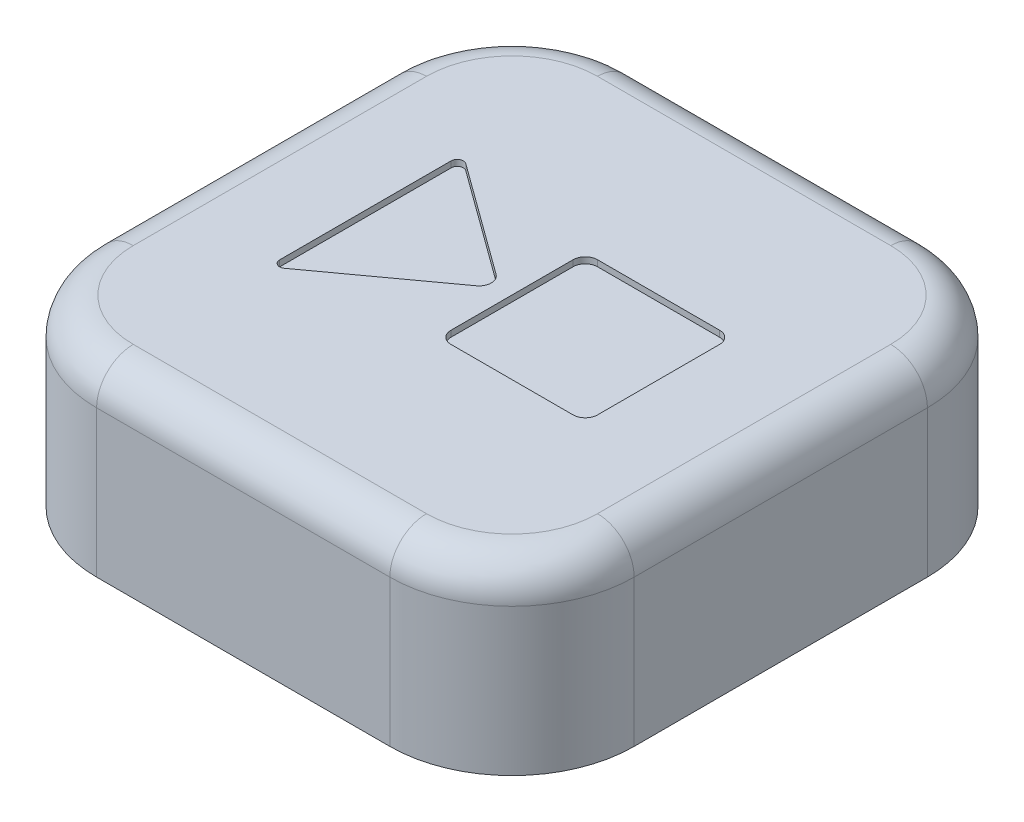
ISO-10303-21;
HEADER;
FILE_DESCRIPTION(('STEP AP214'),'2;1');
FILE_NAME('part.step','',(''),(''),'','','');
FILE_SCHEMA(('AUTOMOTIVE_DESIGN { 1 0 10303 214 1 1 1 1 }'));
ENDSEC;
DATA;
#1=APPLICATION_CONTEXT('core data for automotive mechanical design processes');
#2=APPLICATION_PROTOCOL_DEFINITION('international standard','automotive_design',2000,#1);
#3=PRODUCT_CONTEXT('',#1,'mechanical');
#4=PRODUCT('Part','Part','',(#3));
#5=PRODUCT_RELATED_PRODUCT_CATEGORY('part','',(#4));
#6=PRODUCT_DEFINITION_FORMATION('','',#4);
#7=PRODUCT_DEFINITION_CONTEXT('part definition',#1,'design');
#8=PRODUCT_DEFINITION('design','',#6,#7);
#9=PRODUCT_DEFINITION_SHAPE('','',#8);
#10=(LENGTH_UNIT() NAMED_UNIT(*) SI_UNIT(.MILLI.,.METRE.));
#11=(NAMED_UNIT(*) PLANE_ANGLE_UNIT() SI_UNIT($,.RADIAN.));
#12=(NAMED_UNIT(*) SI_UNIT($,.STERADIAN.) SOLID_ANGLE_UNIT());
#13=UNCERTAINTY_MEASURE_WITH_UNIT(LENGTH_MEASURE(1.E-05),#10,'distance_accuracy_value','');
#14=(GEOMETRIC_REPRESENTATION_CONTEXT(3) GLOBAL_UNCERTAINTY_ASSIGNED_CONTEXT((#13)) GLOBAL_UNIT_ASSIGNED_CONTEXT((#10,
#11,#12)) REPRESENTATION_CONTEXT('',''));
#15=CARTESIAN_POINT('',(0.,0.,0.));
#16=DIRECTION('',(0.,0.,1.));
#17=DIRECTION('',(1.,0.,0.));
#18=AXIS2_PLACEMENT_3D('',#15,#16,#17);
#19=CARTESIAN_POINT('',(-12.,15.,12.));
#20=DIRECTION('',(0.,-1.,0.));
#21=DIRECTION('',(0.,0.,-1.));
#22=AXIS2_PLACEMENT_3D('',#19,#20,#21);
#23=CYLINDRICAL_SURFACE('',#22,10.);
#24=DIRECTION('',(0.,-1.,0.));
#25=VECTOR('',#24,1.);
#26=CARTESIAN_POINT('',(-11.9999999999999,15.,22.));
#27=LINE('',#26,#25);
#28=CARTESIAN_POINT('',(-11.9999999999999,12.,22.));
#29=VERTEX_POINT('',#28);
#30=CARTESIAN_POINT('',(-11.9999999999999,0.,22.));
#31=VERTEX_POINT('',#30);
#32=EDGE_CURVE('E407',#29,#31,#27,.T.);
#33=ORIENTED_EDGE('',*,*,#32,.F.);
#34=CARTESIAN_POINT('',(-12.,12.,12.));
#35=DIRECTION('',(0.,-1.,0.));
#36=DIRECTION('',(0.,0.,-1.));
#37=AXIS2_PLACEMENT_3D('',#34,#35,#36);
#38=CIRCLE('',#37,10.);
#39=CARTESIAN_POINT('',(-22.,12.,11.9999999999999));
#40=VERTEX_POINT('',#39);
#41=EDGE_CURVE('E12',#29,#40,#38,.T.);
#42=ORIENTED_EDGE('',*,*,#41,.T.);
#43=DIRECTION('',(0.,-1.,0.));
#44=VECTOR('',#43,1.);
#45=CARTESIAN_POINT('',(-22.,15.,11.9999999999999));
#46=LINE('',#45,#44);
#47=CARTESIAN_POINT('',(-22.,0.,11.9999999999999));
#48=VERTEX_POINT('',#47);
#49=EDGE_CURVE('E393',#40,#48,#46,.T.);
#50=ORIENTED_EDGE('',*,*,#49,.T.);
#51=CARTESIAN_POINT('',(-12.,0.,12.));
#52=DIRECTION('',(0.,1.,0.));
#53=DIRECTION('',(0.,0.,-1.));
#54=AXIS2_PLACEMENT_3D('',#51,#52,#53);
#55=CIRCLE('',#54,10.);
#56=EDGE_CURVE('E369',#48,#31,#55,.T.);
#57=ORIENTED_EDGE('',*,*,#56,.T.);
#58=EDGE_LOOP('',(#33,#42,#50,#57));
#59=FACE_BOUND('',#58,.T.);
#60=ADVANCED_FACE('F43',(#59),#23,.T.);
#61=CARTESIAN_POINT('',(-11.9999999999999,15.,22.));
#62=DIRECTION('',(0.,0.,-1.));
#63=DIRECTION('',(-1.,0.,0.));
#64=AXIS2_PLACEMENT_3D('',#61,#62,#63);
#65=PLANE('',#64);
#66=DIRECTION('',(0.,-1.,0.));
#67=VECTOR('',#66,1.);
#68=CARTESIAN_POINT('',(11.9999999999999,15.,22.));
#69=LINE('',#68,#67);
#70=CARTESIAN_POINT('',(11.9999999999999,12.,22.));
#71=VERTEX_POINT('',#70);
#72=CARTESIAN_POINT('',(11.9999999999999,0.,22.));
#73=VERTEX_POINT('',#72);
#74=EDGE_CURVE('E405',#71,#73,#69,.T.);
#75=ORIENTED_EDGE('',*,*,#74,.F.);
#76=DIRECTION('',(1.,0.,0.));
#77=VECTOR('',#76,1.);
#78=CARTESIAN_POINT('',(-11.9999999999999,12.,22.));
#79=LINE('',#78,#77);
#80=EDGE_CURVE('E52',#71,#29,#79,.F.);
#81=ORIENTED_EDGE('',*,*,#80,.T.);
#82=ORIENTED_EDGE('',*,*,#32,.T.);
#83=DIRECTION('',(1.,0.,0.));
#84=VECTOR('',#83,1.);
#85=CARTESIAN_POINT('',(-11.9999999999999,0.,22.));
#86=LINE('',#85,#84);
#87=EDGE_CURVE('E372',#31,#73,#86,.T.);
#88=ORIENTED_EDGE('',*,*,#87,.T.);
#89=EDGE_LOOP('',(#75,#81,#82,#88));
#90=FACE_BOUND('',#89,.T.);
#91=ADVANCED_FACE('F515',(#90),#65,.F.);
#92=CARTESIAN_POINT('',(12.,15.,12.));
#93=DIRECTION('',(0.,-1.,0.));
#94=DIRECTION('',(0.,0.,-1.));
#95=AXIS2_PLACEMENT_3D('',#92,#93,#94);
#96=CYLINDRICAL_SURFACE('',#95,10.);
#97=DIRECTION('',(0.,-1.,0.));
#98=VECTOR('',#97,1.);
#99=CARTESIAN_POINT('',(22.,15.,11.9999999999999));
#100=LINE('',#99,#98);
#101=CARTESIAN_POINT('',(22.,12.,11.9999999999999));
#102=VERTEX_POINT('',#101);
#103=CARTESIAN_POINT('',(22.,0.,11.9999999999999));
#104=VERTEX_POINT('',#103);
#105=EDGE_CURVE('E403',#102,#104,#100,.T.);
#106=ORIENTED_EDGE('',*,*,#105,.F.);
#107=CARTESIAN_POINT('',(12.,12.,12.));
#108=DIRECTION('',(0.,-1.,0.));
#109=DIRECTION('',(0.,0.,-1.));
#110=AXIS2_PLACEMENT_3D('',#107,#108,#109);
#111=CIRCLE('',#110,10.);
#112=EDGE_CURVE('E437',#102,#71,#111,.T.);
#113=ORIENTED_EDGE('',*,*,#112,.T.);
#114=ORIENTED_EDGE('',*,*,#74,.T.);
#115=CARTESIAN_POINT('',(12.,0.,12.));
#116=DIRECTION('',(0.,1.,0.));
#117=DIRECTION('',(0.,0.,1.));
#118=AXIS2_PLACEMENT_3D('',#115,#116,#117);
#119=CIRCLE('',#118,10.);
#120=EDGE_CURVE('E375',#73,#104,#119,.T.);
#121=ORIENTED_EDGE('',*,*,#120,.T.);
#122=EDGE_LOOP('',(#106,#113,#114,#121));
#123=FACE_BOUND('',#122,.T.);
#124=ADVANCED_FACE('F475',(#123),#96,.T.);
#125=CARTESIAN_POINT('',(22.,15.,11.9999999999999));
#126=DIRECTION('',(-1.,0.,0.));
#127=DIRECTION('',(0.,0.,1.));
#128=AXIS2_PLACEMENT_3D('',#125,#126,#127);
#129=PLANE('',#128);
#130=DIRECTION('',(0.,-1.,0.));
#131=VECTOR('',#130,1.);
#132=CARTESIAN_POINT('',(22.,15.,-11.9999999999999));
#133=LINE('',#132,#131);
#134=CARTESIAN_POINT('',(22.,12.,-11.9999999999999));
#135=VERTEX_POINT('',#134);
#136=CARTESIAN_POINT('',(22.,0.,-11.9999999999999));
#137=VERTEX_POINT('',#136);
#138=EDGE_CURVE('E401',#135,#137,#133,.T.);
#139=ORIENTED_EDGE('',*,*,#138,.F.);
#140=DIRECTION('',(0.,0.,-1.));
#141=VECTOR('',#140,1.);
#142=CARTESIAN_POINT('',(22.,12.,11.9999999999999));
#143=LINE('',#142,#141);
#144=EDGE_CURVE('E435',#135,#102,#143,.F.);
#145=ORIENTED_EDGE('',*,*,#144,.T.);
#146=ORIENTED_EDGE('',*,*,#105,.T.);
#147=DIRECTION('',(0.,0.,-1.));
#148=VECTOR('',#147,1.);
#149=CARTESIAN_POINT('',(22.,0.,11.9999999999999));
#150=LINE('',#149,#148);
#151=EDGE_CURVE('E378',#104,#137,#150,.T.);
#152=ORIENTED_EDGE('',*,*,#151,.T.);
#153=EDGE_LOOP('',(#139,#145,#146,#152));
#154=FACE_BOUND('',#153,.T.);
#155=ADVANCED_FACE('F473',(#154),#129,.F.);
#156=CARTESIAN_POINT('',(12.,15.,-12.));
#157=DIRECTION('',(0.,-1.,0.));
#158=DIRECTION('',(0.,0.,-1.));
#159=AXIS2_PLACEMENT_3D('',#156,#157,#158);
#160=CYLINDRICAL_SURFACE('',#159,10.);
#161=DIRECTION('',(0.,-1.,0.));
#162=VECTOR('',#161,1.);
#163=CARTESIAN_POINT('',(11.9999999999999,15.,-22.));
#164=LINE('',#163,#162);
#165=CARTESIAN_POINT('',(11.9999999999999,12.,-22.));
#166=VERTEX_POINT('',#165);
#167=CARTESIAN_POINT('',(11.9999999999999,0.,-22.));
#168=VERTEX_POINT('',#167);
#169=EDGE_CURVE('E399',#166,#168,#164,.T.);
#170=ORIENTED_EDGE('',*,*,#169,.F.);
#171=CARTESIAN_POINT('',(12.,12.,-12.));
#172=DIRECTION('',(0.,-1.,0.));
#173=DIRECTION('',(0.,0.,-1.));
#174=AXIS2_PLACEMENT_3D('',#171,#172,#173);
#175=CIRCLE('',#174,10.);
#176=EDGE_CURVE('E433',#166,#135,#175,.T.);
#177=ORIENTED_EDGE('',*,*,#176,.T.);
#178=ORIENTED_EDGE('',*,*,#138,.T.);
#179=CARTESIAN_POINT('',(12.,0.,-12.));
#180=DIRECTION('',(0.,1.,0.));
#181=DIRECTION('',(0.,0.,-1.));
#182=AXIS2_PLACEMENT_3D('',#179,#180,#181);
#183=CIRCLE('',#182,10.);
#184=EDGE_CURVE('E381',#137,#168,#183,.T.);
#185=ORIENTED_EDGE('',*,*,#184,.T.);
#186=EDGE_LOOP('',(#170,#177,#178,#185));
#187=FACE_BOUND('',#186,.T.);
#188=ADVANCED_FACE('F488',(#187),#160,.T.);
#189=CARTESIAN_POINT('',(-11.9999999999999,15.,-22.));
#190=DIRECTION('',(0.,0.,1.));
#191=DIRECTION('',(1.,0.,0.));
#192=AXIS2_PLACEMENT_3D('',#189,#190,#191);
#193=PLANE('',#192);
#194=DIRECTION('',(0.,-1.,0.));
#195=VECTOR('',#194,1.);
#196=CARTESIAN_POINT('',(-11.9999999999999,15.,-22.));
#197=LINE('',#196,#195);
#198=CARTESIAN_POINT('',(-11.9999999999999,12.,-22.));
#199=VERTEX_POINT('',#198);
#200=CARTESIAN_POINT('',(-11.9999999999999,0.,-22.));
#201=VERTEX_POINT('',#200);
#202=EDGE_CURVE('E397',#199,#201,#197,.T.);
#203=ORIENTED_EDGE('',*,*,#202,.F.);
#204=DIRECTION('',(-1.,0.,0.));
#205=VECTOR('',#204,1.);
#206=CARTESIAN_POINT('',(-11.9999999999999,12.,-22.));
#207=LINE('',#206,#205);
#208=EDGE_CURVE('E431',#199,#166,#207,.F.);
#209=ORIENTED_EDGE('',*,*,#208,.T.);
#210=ORIENTED_EDGE('',*,*,#169,.T.);
#211=DIRECTION('',(-1.,0.,0.));
#212=VECTOR('',#211,1.);
#213=CARTESIAN_POINT('',(-11.9999999999999,0.,-22.));
#214=LINE('',#213,#212);
#215=EDGE_CURVE('E384',#168,#201,#214,.T.);
#216=ORIENTED_EDGE('',*,*,#215,.T.);
#217=EDGE_LOOP('',(#203,#209,#210,#216));
#218=FACE_BOUND('',#217,.T.);
#219=ADVANCED_FACE('F491',(#218),#193,.F.);
#220=CARTESIAN_POINT('',(-12.,15.,-12.));
#221=DIRECTION('',(0.,-1.,0.));
#222=DIRECTION('',(0.,0.,-1.));
#223=AXIS2_PLACEMENT_3D('',#220,#221,#222);
#224=CYLINDRICAL_SURFACE('',#223,10.);
#225=DIRECTION('',(0.,-1.,0.));
#226=VECTOR('',#225,1.);
#227=CARTESIAN_POINT('',(-22.,15.,-11.9999999999999));
#228=LINE('',#227,#226);
#229=CARTESIAN_POINT('',(-22.,12.,-11.9999999999999));
#230=VERTEX_POINT('',#229);
#231=CARTESIAN_POINT('',(-22.,0.,-11.9999999999999));
#232=VERTEX_POINT('',#231);
#233=EDGE_CURVE('E395',#230,#232,#228,.T.);
#234=ORIENTED_EDGE('',*,*,#233,.F.);
#235=CARTESIAN_POINT('',(-12.,12.,-12.));
#236=DIRECTION('',(0.,-1.,0.));
#237=DIRECTION('',(0.,0.,-1.));
#238=AXIS2_PLACEMENT_3D('',#235,#236,#237);
#239=CIRCLE('',#238,10.);
#240=EDGE_CURVE('E429',#230,#199,#239,.T.);
#241=ORIENTED_EDGE('',*,*,#240,.T.);
#242=ORIENTED_EDGE('',*,*,#202,.T.);
#243=CARTESIAN_POINT('',(-12.,0.,-12.));
#244=DIRECTION('',(0.,1.,0.));
#245=DIRECTION('',(0.,0.,-1.));
#246=AXIS2_PLACEMENT_3D('',#243,#244,#245);
#247=CIRCLE('',#246,10.);
#248=EDGE_CURVE('E387',#201,#232,#247,.T.);
#249=ORIENTED_EDGE('',*,*,#248,.T.);
#250=EDGE_LOOP('',(#234,#241,#242,#249));
#251=FACE_BOUND('',#250,.T.);
#252=ADVANCED_FACE('F524',(#251),#224,.T.);
#253=CARTESIAN_POINT('',(-22.,15.,11.9999999999999));
#254=DIRECTION('',(1.,0.,0.));
#255=DIRECTION('',(0.,0.,-1.));
#256=AXIS2_PLACEMENT_3D('',#253,#254,#255);
#257=PLANE('',#256);
#258=ORIENTED_EDGE('',*,*,#49,.F.);
#259=DIRECTION('',(0.,0.,1.));
#260=VECTOR('',#259,1.);
#261=CARTESIAN_POINT('',(-22.,12.,11.9999999999999));
#262=LINE('',#261,#260);
#263=EDGE_CURVE('E426',#40,#230,#262,.F.);
#264=ORIENTED_EDGE('',*,*,#263,.T.);
#265=ORIENTED_EDGE('',*,*,#233,.T.);
#266=DIRECTION('',(0.,0.,1.));
#267=VECTOR('',#266,1.);
#268=CARTESIAN_POINT('',(-22.,0.,11.9999999999999));
#269=LINE('',#268,#267);
#270=EDGE_CURVE('E390',#232,#48,#269,.T.);
#271=ORIENTED_EDGE('',*,*,#270,.T.);
#272=EDGE_LOOP('',(#258,#264,#265,#271));
#273=FACE_BOUND('',#272,.T.);
#274=ADVANCED_FACE('F520',(#273),#257,.F.);
#275=CARTESIAN_POINT('',(-12.,15.,12.));
#276=DIRECTION('',(0.,-1.,0.));
#277=DIRECTION('',(0.,0.,-1.));
#278=AXIS2_PLACEMENT_3D('',#275,#276,#277);
#279=PLANE('',#278);
#280=DIRECTION('',(0.,0.,-1.));
#281=VECTOR('',#280,1.);
#282=CARTESIAN_POINT('',(12.,15.,-5.));
#283=LINE('',#282,#281);
#284=CARTESIAN_POINT('',(12.,15.,5.));
#285=VERTEX_POINT('',#284);
#286=CARTESIAN_POINT('',(12.,15.,-5.));
#287=VERTEX_POINT('',#286);
#288=EDGE_CURVE('E281',#285,#287,#283,.T.);
#289=ORIENTED_EDGE('',*,*,#288,.F.);
#290=CARTESIAN_POINT('',(11.,15.,5.));
#291=DIRECTION('',(0.,1.,0.));
#292=DIRECTION('',(0.,0.,1.));
#293=AXIS2_PLACEMENT_3D('',#290,#291,#292);
#294=CIRCLE('',#293,0.999999999999999);
#295=CARTESIAN_POINT('',(11.,15.,6.));
#296=VERTEX_POINT('',#295);
#297=EDGE_CURVE('E60',#296,#285,#294,.T.);
#298=ORIENTED_EDGE('',*,*,#297,.F.);
#299=DIRECTION('',(1.,0.,0.));
#300=VECTOR('',#299,1.);
#301=CARTESIAN_POINT('',(1.,15.,6.));
#302=LINE('',#301,#300);
#303=CARTESIAN_POINT('',(1.,15.,6.));
#304=VERTEX_POINT('',#303);
#305=EDGE_CURVE('E240',#304,#296,#302,.T.);
#306=ORIENTED_EDGE('',*,*,#305,.F.);
#307=CARTESIAN_POINT('',(1.,15.,5.));
#308=DIRECTION('',(0.,1.,0.));
#309=DIRECTION('',(0.,0.,1.));
#310=AXIS2_PLACEMENT_3D('',#307,#308,#309);
#311=CIRCLE('',#310,1.);
#312=CARTESIAN_POINT('',(0.,15.,5.));
#313=VERTEX_POINT('',#312);
#314=EDGE_CURVE('E244',#313,#304,#311,.T.);
#315=ORIENTED_EDGE('',*,*,#314,.F.);
#316=DIRECTION('',(0.,0.,1.));
#317=VECTOR('',#316,1.);
#318=CARTESIAN_POINT('',(0.,15.,-5.));
#319=LINE('',#318,#317);
#320=CARTESIAN_POINT('',(0.,15.,-5.));
#321=VERTEX_POINT('',#320);
#322=EDGE_CURVE('E293',#321,#313,#319,.T.);
#323=ORIENTED_EDGE('',*,*,#322,.F.);
#324=CARTESIAN_POINT('',(1.,15.,-5.));
#325=DIRECTION('',(0.,1.,0.));
#326=DIRECTION('',(0.,0.,1.));
#327=AXIS2_PLACEMENT_3D('',#324,#325,#326);
#328=CIRCLE('',#327,1.);
#329=CARTESIAN_POINT('',(1.,15.,-6.));
#330=VERTEX_POINT('',#329);
#331=EDGE_CURVE('E290',#330,#321,#328,.T.);
#332=ORIENTED_EDGE('',*,*,#331,.F.);
#333=DIRECTION('',(-1.,0.,0.));
#334=VECTOR('',#333,1.);
#335=CARTESIAN_POINT('',(1.,15.,-6.));
#336=LINE('',#335,#334);
#337=CARTESIAN_POINT('',(11.,15.,-6.));
#338=VERTEX_POINT('',#337);
#339=EDGE_CURVE('E287',#338,#330,#336,.T.);
#340=ORIENTED_EDGE('',*,*,#339,.F.);
#341=CARTESIAN_POINT('',(11.,15.,-5.));
#342=DIRECTION('',(0.,1.,0.));
#343=DIRECTION('',(0.,0.,-1.));
#344=AXIS2_PLACEMENT_3D('',#341,#342,#343);
#345=CIRCLE('',#344,1.);
#346=EDGE_CURVE('E284',#287,#338,#345,.T.);
#347=ORIENTED_EDGE('',*,*,#346,.F.);
#348=EDGE_LOOP('',(#289,#298,#306,#315,#323,#332,#340,#347));
#349=FACE_BOUND('',#348,.T.);
#350=DIRECTION('',(-0.808736084303189,0.,-0.588171697675046));
#351=VECTOR('',#350,1.);
#352=CARTESIAN_POINT('',(-2.11201211591688,15.,-0.808736084303189));
#353=LINE('',#352,#351);
#354=CARTESIAN_POINT('',(-2.11201211591688,15.,-0.808736084303184));
#355=VERTEX_POINT('',#354);
#356=CARTESIAN_POINT('',(-11.2059141511625,15.,-7.4224830190272));
#357=VERTEX_POINT('',#356);
#358=EDGE_CURVE('E345',#355,#357,#353,.T.);
#359=ORIENTED_EDGE('',*,*,#358,.F.);
#360=CARTESIAN_POINT('',(-2.70018381359193,15.,0.));
#361=DIRECTION('',(0.,1.,0.));
#362=DIRECTION('',(0.,0.,1.));
#363=AXIS2_PLACEMENT_3D('',#360,#361,#362);
#364=CIRCLE('',#363,1.);
#365=CARTESIAN_POINT('',(-2.11201211591688,15.,0.808736084303189));
#366=VERTEX_POINT('',#365);
#367=EDGE_CURVE('E68',#366,#355,#364,.T.);
#368=ORIENTED_EDGE('',*,*,#367,.F.);
#369=DIRECTION('',(0.808736084303189,0.,-0.588171697675046));
#370=VECTOR('',#369,1.);
#371=CARTESIAN_POINT('',(-11.2059141511624,15.,7.42248301902722));
#372=LINE('',#371,#370);
#373=CARTESIAN_POINT('',(-11.2059141511624,15.,7.42248301902722));
#374=VERTEX_POINT('',#373);
#375=EDGE_CURVE('E318',#374,#366,#372,.T.);
#376=ORIENTED_EDGE('',*,*,#375,.F.);
#377=CARTESIAN_POINT('',(-11.5,15.,7.01811497687557));
#378=DIRECTION('',(0.,1.,0.));
#379=DIRECTION('',(0.,0.,1.));
#380=AXIS2_PLACEMENT_3D('',#377,#378,#379);
#381=CIRCLE('',#380,0.500000000000036);
#382=CARTESIAN_POINT('',(-12.,15.,7.01811497687557));
#383=VERTEX_POINT('',#382);
#384=EDGE_CURVE('E354',#383,#374,#381,.T.);
#385=ORIENTED_EDGE('',*,*,#384,.F.);
#386=DIRECTION('',(0.,0.,1.));
#387=VECTOR('',#386,1.);
#388=CARTESIAN_POINT('',(-12.,15.,-7.01811497687557));
#389=LINE('',#388,#387);
#390=CARTESIAN_POINT('',(-12.,15.,-7.01811497687557));
#391=VERTEX_POINT('',#390);
#392=EDGE_CURVE('E351',#391,#383,#389,.T.);
#393=ORIENTED_EDGE('',*,*,#392,.F.);
#394=CARTESIAN_POINT('',(-11.5,15.,-7.01811497687557));
#395=DIRECTION('',(0.,1.,0.));
#396=DIRECTION('',(0.,0.,-1.));
#397=AXIS2_PLACEMENT_3D('',#394,#395,#396);
#398=CIRCLE('',#397,0.500000000000035);
#399=EDGE_CURVE('E348',#357,#391,#398,.T.);
#400=ORIENTED_EDGE('',*,*,#399,.F.);
#401=EDGE_LOOP('',(#359,#368,#376,#385,#393,#400));
#402=FACE_BOUND('',#401,.T.);
#403=CARTESIAN_POINT('',(-12.,15.,-12.));
#404=DIRECTION('',(0.,-1.,0.));
#405=DIRECTION('',(0.,0.,-1.));
#406=AXIS2_PLACEMENT_3D('',#403,#404,#405);
#407=CIRCLE('',#406,7.);
#408=CARTESIAN_POINT('',(-11.9999999999999,15.,-19.));
#409=VERTEX_POINT('',#408);
#410=CARTESIAN_POINT('',(-19.,15.,-11.9999999999999));
#411=VERTEX_POINT('',#410);
#412=EDGE_CURVE('E421',#409,#411,#407,.F.);
#413=ORIENTED_EDGE('',*,*,#412,.T.);
#414=DIRECTION('',(0.,0.,1.));
#415=VECTOR('',#414,1.);
#416=CARTESIAN_POINT('',(-19.,15.,12.));
#417=LINE('',#416,#415);
#418=CARTESIAN_POINT('',(-19.,15.,11.9999999999999));
#419=VERTEX_POINT('',#418);
#420=EDGE_CURVE('E423',#411,#419,#417,.T.);
#421=ORIENTED_EDGE('',*,*,#420,.T.);
#422=CARTESIAN_POINT('',(-12.,15.,12.));
#423=DIRECTION('',(0.,-1.,0.));
#424=DIRECTION('',(0.,0.,-1.));
#425=AXIS2_PLACEMENT_3D('',#422,#423,#424);
#426=CIRCLE('',#425,7.);
#427=CARTESIAN_POINT('',(-11.9999999999999,15.,19.));
#428=VERTEX_POINT('',#427);
#429=EDGE_CURVE('E409',#419,#428,#426,.F.);
#430=ORIENTED_EDGE('',*,*,#429,.T.);
#431=DIRECTION('',(1.,0.,0.));
#432=VECTOR('',#431,1.);
#433=CARTESIAN_POINT('',(-12.,15.,19.));
#434=LINE('',#433,#432);
#435=CARTESIAN_POINT('',(11.9999999999999,15.,19.));
#436=VERTEX_POINT('',#435);
#437=EDGE_CURVE('E411',#428,#436,#434,.T.);
#438=ORIENTED_EDGE('',*,*,#437,.T.);
#439=CARTESIAN_POINT('',(12.,15.,12.));
#440=DIRECTION('',(0.,-1.,0.));
#441=DIRECTION('',(0.,0.,-1.));
#442=AXIS2_PLACEMENT_3D('',#439,#440,#441);
#443=CIRCLE('',#442,7.);
#444=CARTESIAN_POINT('',(19.,15.,11.9999999999999));
#445=VERTEX_POINT('',#444);
#446=EDGE_CURVE('E413',#436,#445,#443,.F.);
#447=ORIENTED_EDGE('',*,*,#446,.T.);
#448=DIRECTION('',(0.,0.,-1.));
#449=VECTOR('',#448,1.);
#450=CARTESIAN_POINT('',(19.,15.,12.));
#451=LINE('',#450,#449);
#452=CARTESIAN_POINT('',(19.,15.,-12.));
#453=VERTEX_POINT('',#452);
#454=EDGE_CURVE('E415',#445,#453,#451,.T.);
#455=ORIENTED_EDGE('',*,*,#454,.T.);
#456=CARTESIAN_POINT('',(12.,15.,-12.));
#457=DIRECTION('',(0.,-1.,0.));
#458=DIRECTION('',(0.,0.,-1.));
#459=AXIS2_PLACEMENT_3D('',#456,#457,#458);
#460=CIRCLE('',#459,7.);
#461=CARTESIAN_POINT('',(11.9999999999999,15.,-19.));
#462=VERTEX_POINT('',#461);
#463=EDGE_CURVE('E417',#453,#462,#460,.F.);
#464=ORIENTED_EDGE('',*,*,#463,.T.);
#465=DIRECTION('',(-1.,0.,0.));
#466=VECTOR('',#465,1.);
#467=CARTESIAN_POINT('',(-12.,15.,-19.));
#468=LINE('',#467,#466);
#469=EDGE_CURVE('E419',#462,#409,#468,.T.);
#470=ORIENTED_EDGE('',*,*,#469,.T.);
#471=EDGE_LOOP('',(#413,#421,#430,#438,#447,#455,#464,#470));
#472=FACE_BOUND('',#471,.T.);
#473=ADVANCED_FACE('F504',(#349,#402,#472),#279,.F.);
#474=CARTESIAN_POINT('',(-12.,0.,12.));
#475=DIRECTION('',(0.,-1.,0.));
#476=DIRECTION('',(0.,0.,-1.));
#477=AXIS2_PLACEMENT_3D('',#474,#475,#476);
#478=PLANE('',#477);
#479=ORIENTED_EDGE('',*,*,#56,.F.);
#480=ORIENTED_EDGE('',*,*,#270,.F.);
#481=ORIENTED_EDGE('',*,*,#248,.F.);
#482=ORIENTED_EDGE('',*,*,#215,.F.);
#483=ORIENTED_EDGE('',*,*,#184,.F.);
#484=ORIENTED_EDGE('',*,*,#151,.F.);
#485=ORIENTED_EDGE('',*,*,#120,.F.);
#486=ORIENTED_EDGE('',*,*,#87,.F.);
#487=EDGE_LOOP('',(#479,#480,#481,#482,#483,#484,#485,#486));
#488=FACE_BOUND('',#487,.T.);
#489=ADVANCED_FACE('F483',(#488),#478,.T.);
#490=CARTESIAN_POINT('',(19.,12.,12.));
#491=DIRECTION('',(0.,0.,-1.));
#492=DIRECTION('',(-1.,0.,0.));
#493=AXIS2_PLACEMENT_3D('',#490,#491,#492);
#494=CYLINDRICAL_SURFACE('',#493,3.);
#495=CARTESIAN_POINT('',(19.,12.,11.9999999999999));
#496=DIRECTION('',(0.,0.,1.));
#497=DIRECTION('',(1.,0.,0.));
#498=AXIS2_PLACEMENT_3D('',#495,#496,#497);
#499=CIRCLE('',#498,3.);
#500=EDGE_CURVE('E454',#102,#445,#499,.T.);
#501=ORIENTED_EDGE('',*,*,#500,.F.);
#502=ORIENTED_EDGE('',*,*,#144,.F.);
#503=CARTESIAN_POINT('',(19.,12.,-12.));
#504=DIRECTION('',(0.,0.,-1.));
#505=DIRECTION('',(-1.,0.,0.));
#506=AXIS2_PLACEMENT_3D('',#503,#504,#505);
#507=CIRCLE('',#506,3.);
#508=EDGE_CURVE('E47',#453,#135,#507,.T.);
#509=ORIENTED_EDGE('',*,*,#508,.F.);
#510=ORIENTED_EDGE('',*,*,#454,.F.);
#511=EDGE_LOOP('',(#501,#502,#509,#510));
#512=FACE_BOUND('',#511,.T.);
#513=ADVANCED_FACE('F45',(#512),#494,.T.);
#514=CARTESIAN_POINT('',(12.,12.,-12.));
#515=DIRECTION('',(0.,-1.,0.));
#516=DIRECTION('',(0.,0.,-1.));
#517=AXIS2_PLACEMENT_3D('',#514,#515,#516);
#518=TOROIDAL_SURFACE('',#517,7.,3.);
#519=ORIENTED_EDGE('',*,*,#508,.T.);
#520=ORIENTED_EDGE('',*,*,#176,.F.);
#521=CARTESIAN_POINT('',(11.9999999999999,12.,-19.));
#522=DIRECTION('',(-1.,0.,0.));
#523=DIRECTION('',(0.,0.,1.));
#524=AXIS2_PLACEMENT_3D('',#521,#522,#523);
#525=CIRCLE('',#524,3.);
#526=EDGE_CURVE('E452',#462,#166,#525,.T.);
#527=ORIENTED_EDGE('',*,*,#526,.F.);
#528=ORIENTED_EDGE('',*,*,#463,.F.);
#529=EDGE_LOOP('',(#519,#520,#527,#528));
#530=FACE_BOUND('',#529,.T.);
#531=ADVANCED_FACE('F465',(#530),#518,.T.);
#532=CARTESIAN_POINT('',(12.,12.,12.));
#533=DIRECTION('',(0.,-1.,0.));
#534=DIRECTION('',(0.,0.,-1.));
#535=AXIS2_PLACEMENT_3D('',#532,#533,#534);
#536=TOROIDAL_SURFACE('',#535,7.,3.);
#537=ORIENTED_EDGE('',*,*,#500,.T.);
#538=ORIENTED_EDGE('',*,*,#446,.F.);
#539=CARTESIAN_POINT('',(11.9999999999999,12.,19.));
#540=DIRECTION('',(-1.,0.,0.));
#541=DIRECTION('',(0.,0.,1.));
#542=AXIS2_PLACEMENT_3D('',#539,#540,#541);
#543=CIRCLE('',#542,3.);
#544=EDGE_CURVE('E449',#71,#436,#543,.T.);
#545=ORIENTED_EDGE('',*,*,#544,.F.);
#546=ORIENTED_EDGE('',*,*,#112,.F.);
#547=EDGE_LOOP('',(#537,#538,#545,#546));
#548=FACE_BOUND('',#547,.T.);
#549=ADVANCED_FACE('F507',(#548),#536,.T.);
#550=CARTESIAN_POINT('',(-12.,12.,-19.));
#551=DIRECTION('',(-1.,0.,0.));
#552=DIRECTION('',(0.,0.,1.));
#553=AXIS2_PLACEMENT_3D('',#550,#551,#552);
#554=CYLINDRICAL_SURFACE('',#553,3.);
#555=ORIENTED_EDGE('',*,*,#526,.T.);
#556=ORIENTED_EDGE('',*,*,#208,.F.);
#557=CARTESIAN_POINT('',(-11.9999999999999,12.,-19.));
#558=DIRECTION('',(-1.,0.,0.));
#559=DIRECTION('',(0.,0.,1.));
#560=AXIS2_PLACEMENT_3D('',#557,#558,#559);
#561=CIRCLE('',#560,3.);
#562=EDGE_CURVE('E446',#409,#199,#561,.T.);
#563=ORIENTED_EDGE('',*,*,#562,.F.);
#564=ORIENTED_EDGE('',*,*,#469,.F.);
#565=EDGE_LOOP('',(#555,#556,#563,#564));
#566=FACE_BOUND('',#565,.T.);
#567=ADVANCED_FACE('F495',(#566),#554,.T.);
#568=CARTESIAN_POINT('',(-12.,12.,19.));
#569=DIRECTION('',(1.,0.,0.));
#570=DIRECTION('',(0.,0.,-1.));
#571=AXIS2_PLACEMENT_3D('',#568,#569,#570);
#572=CYLINDRICAL_SURFACE('',#571,3.);
#573=ORIENTED_EDGE('',*,*,#544,.T.);
#574=ORIENTED_EDGE('',*,*,#437,.F.);
#575=CARTESIAN_POINT('',(-11.9999999999999,12.,19.));
#576=DIRECTION('',(-1.,0.,0.));
#577=DIRECTION('',(0.,0.,1.));
#578=AXIS2_PLACEMENT_3D('',#575,#576,#577);
#579=CIRCLE('',#578,3.);
#580=EDGE_CURVE('E443',#29,#428,#579,.T.);
#581=ORIENTED_EDGE('',*,*,#580,.F.);
#582=ORIENTED_EDGE('',*,*,#80,.F.);
#583=EDGE_LOOP('',(#573,#574,#581,#582));
#584=FACE_BOUND('',#583,.T.);
#585=ADVANCED_FACE('F510',(#584),#572,.T.);
#586=CARTESIAN_POINT('',(-12.,12.,-12.));
#587=DIRECTION('',(0.,-1.,0.));
#588=DIRECTION('',(0.,0.,-1.));
#589=AXIS2_PLACEMENT_3D('',#586,#587,#588);
#590=TOROIDAL_SURFACE('',#589,7.,3.);
#591=ORIENTED_EDGE('',*,*,#562,.T.);
#592=ORIENTED_EDGE('',*,*,#240,.F.);
#593=CARTESIAN_POINT('',(-19.,12.,-11.9999999999999));
#594=DIRECTION('',(0.,0.,1.));
#595=DIRECTION('',(1.,0.,0.));
#596=AXIS2_PLACEMENT_3D('',#593,#594,#595);
#597=CIRCLE('',#596,3.);
#598=EDGE_CURVE('E441',#411,#230,#597,.T.);
#599=ORIENTED_EDGE('',*,*,#598,.F.);
#600=ORIENTED_EDGE('',*,*,#412,.F.);
#601=EDGE_LOOP('',(#591,#592,#599,#600));
#602=FACE_BOUND('',#601,.T.);
#603=ADVANCED_FACE('F500',(#602),#590,.T.);
#604=CARTESIAN_POINT('',(-12.,12.,12.));
#605=DIRECTION('',(0.,-1.,0.));
#606=DIRECTION('',(0.,0.,-1.));
#607=AXIS2_PLACEMENT_3D('',#604,#605,#606);
#608=TOROIDAL_SURFACE('',#607,7.,3.);
#609=ORIENTED_EDGE('',*,*,#580,.T.);
#610=ORIENTED_EDGE('',*,*,#429,.F.);
#611=CARTESIAN_POINT('',(-19.,12.,12.));
#612=DIRECTION('',(0.,0.,-1.));
#613=DIRECTION('',(-1.,0.,0.));
#614=AXIS2_PLACEMENT_3D('',#611,#612,#613);
#615=CIRCLE('',#614,3.);
#616=EDGE_CURVE('E300',#40,#419,#615,.T.);
#617=ORIENTED_EDGE('',*,*,#616,.F.);
#618=ORIENTED_EDGE('',*,*,#41,.F.);
#619=EDGE_LOOP('',(#609,#610,#617,#618));
#620=FACE_BOUND('',#619,.T.);
#621=ADVANCED_FACE('F545',(#620),#608,.T.);
#622=CARTESIAN_POINT('',(-19.,12.,12.));
#623=DIRECTION('',(0.,0.,1.));
#624=DIRECTION('',(1.,0.,0.));
#625=AXIS2_PLACEMENT_3D('',#622,#623,#624);
#626=CYLINDRICAL_SURFACE('',#625,3.);
#627=ORIENTED_EDGE('',*,*,#598,.T.);
#628=ORIENTED_EDGE('',*,*,#263,.F.);
#629=ORIENTED_EDGE('',*,*,#616,.T.);
#630=ORIENTED_EDGE('',*,*,#420,.F.);
#631=EDGE_LOOP('',(#627,#628,#629,#630));
#632=FACE_BOUND('',#631,.T.);
#633=ADVANCED_FACE('F541',(#632),#626,.T.);
#634=CARTESIAN_POINT('',(-2.70018381359193,14.5,0.));
#635=DIRECTION('',(0.,1.,0.));
#636=DIRECTION('',(0.,0.,1.));
#637=AXIS2_PLACEMENT_3D('',#634,#635,#636);
#638=CYLINDRICAL_SURFACE('',#637,1.);
#639=ORIENTED_EDGE('',*,*,#367,.T.);
#640=DIRECTION('',(0.,1.,0.));
#641=VECTOR('',#640,1.);
#642=CARTESIAN_POINT('',(-2.11201211591688,14.5,-0.808736084303189));
#643=LINE('',#642,#641);
#644=CARTESIAN_POINT('',(-2.11201211591688,14.5,-0.808736084303189));
#645=VERTEX_POINT('',#644);
#646=EDGE_CURVE('E343',#645,#355,#643,.T.);
#647=ORIENTED_EDGE('',*,*,#646,.F.);
#648=CARTESIAN_POINT('',(-2.70018381359193,14.5,0.));
#649=DIRECTION('',(0.,1.,0.));
#650=DIRECTION('',(0.,0.,1.));
#651=AXIS2_PLACEMENT_3D('',#648,#649,#650);
#652=CIRCLE('',#651,1.);
#653=CARTESIAN_POINT('',(-2.11201211591688,14.5,0.808736084303189));
#654=VERTEX_POINT('',#653);
#655=EDGE_CURVE('E312',#654,#645,#652,.T.);
#656=ORIENTED_EDGE('',*,*,#655,.F.);
#657=DIRECTION('',(0.,1.,0.));
#658=VECTOR('',#657,1.);
#659=CARTESIAN_POINT('',(-2.11201211591688,14.5,0.808736084303189));
#660=LINE('',#659,#658);
#661=EDGE_CURVE('E282',#654,#366,#660,.T.);
#662=ORIENTED_EDGE('',*,*,#661,.T.);
#663=EDGE_LOOP('',(#639,#647,#656,#662));
#664=FACE_BOUND('',#663,.T.);
#665=ADVANCED_FACE('F544',(#664),#638,.F.);
#666=CARTESIAN_POINT('',(-11.2059141511624,14.5,7.42248301902722));
#667=DIRECTION('',(0.588171697675046,0.,0.808736084303189));
#668=DIRECTION('',(0.808736084303189,0.,-0.588171697675046));
#669=AXIS2_PLACEMENT_3D('',#666,#667,#668);
#670=PLANE('',#669);
#671=ORIENTED_EDGE('',*,*,#375,.T.);
#672=ORIENTED_EDGE('',*,*,#661,.F.);
#673=DIRECTION('',(0.808736084303189,0.,-0.588171697675046));
#674=VECTOR('',#673,1.);
#675=CARTESIAN_POINT('',(-11.2059141511624,14.5,7.42248301902722));
#676=LINE('',#675,#674);
#677=CARTESIAN_POINT('',(-11.2059141511624,14.5,7.42248301902722));
#678=VERTEX_POINT('',#677);
#679=EDGE_CURVE('E339',#678,#654,#676,.T.);
#680=ORIENTED_EDGE('',*,*,#679,.F.);
#681=DIRECTION('',(0.,1.,0.));
#682=VECTOR('',#681,1.);
#683=CARTESIAN_POINT('',(-11.2059141511624,14.5,7.42248301902722));
#684=LINE('',#683,#682);
#685=EDGE_CURVE('E360',#678,#374,#684,.T.);
#686=ORIENTED_EDGE('',*,*,#685,.T.);
#687=EDGE_LOOP('',(#671,#672,#680,#686));
#688=FACE_BOUND('',#687,.T.);
#689=ADVANCED_FACE('F573',(#688),#670,.F.);
#690=CARTESIAN_POINT('',(-11.5,14.5,7.01811497687557));
#691=DIRECTION('',(0.,1.,0.));
#692=DIRECTION('',(0.,0.,1.));
#693=AXIS2_PLACEMENT_3D('',#690,#691,#692);
#694=CYLINDRICAL_SURFACE('',#693,0.500000000000036);
#695=ORIENTED_EDGE('',*,*,#384,.T.);
#696=ORIENTED_EDGE('',*,*,#685,.F.);
#697=CARTESIAN_POINT('',(-11.5,14.5,7.01811497687557));
#698=DIRECTION('',(0.,1.,0.));
#699=DIRECTION('',(0.,0.,1.));
#700=AXIS2_PLACEMENT_3D('',#697,#698,#699);
#701=CIRCLE('',#700,0.500000000000036);
#702=CARTESIAN_POINT('',(-12.,14.5,7.01811497687557));
#703=VERTEX_POINT('',#702);
#704=EDGE_CURVE('E335',#703,#678,#701,.T.);
#705=ORIENTED_EDGE('',*,*,#704,.F.);
#706=DIRECTION('',(0.,1.,0.));
#707=VECTOR('',#706,1.);
#708=CARTESIAN_POINT('',(-12.,14.5,7.01811497687557));
#709=LINE('',#708,#707);
#710=EDGE_CURVE('E362',#703,#383,#709,.T.);
#711=ORIENTED_EDGE('',*,*,#710,.T.);
#712=EDGE_LOOP('',(#695,#696,#705,#711));
#713=FACE_BOUND('',#712,.T.);
#714=ADVANCED_FACE('F586',(#713),#694,.F.);
#715=CARTESIAN_POINT('',(-12.,14.5,-7.01811497687557));
#716=DIRECTION('',(-1.,0.,0.));
#717=DIRECTION('',(0.,0.,1.));
#718=AXIS2_PLACEMENT_3D('',#715,#716,#717);
#719=PLANE('',#718);
#720=ORIENTED_EDGE('',*,*,#392,.T.);
#721=ORIENTED_EDGE('',*,*,#710,.F.);
#722=DIRECTION('',(0.,0.,1.));
#723=VECTOR('',#722,1.);
#724=CARTESIAN_POINT('',(-12.,14.5,-7.01811497687557));
#725=LINE('',#724,#723);
#726=CARTESIAN_POINT('',(-12.,14.5,-7.01811497687557));
#727=VERTEX_POINT('',#726);
#728=EDGE_CURVE('E330',#727,#703,#725,.T.);
#729=ORIENTED_EDGE('',*,*,#728,.F.);
#730=DIRECTION('',(0.,1.,0.));
#731=VECTOR('',#730,1.);
#732=CARTESIAN_POINT('',(-12.,14.5,-7.01811497687557));
#733=LINE('',#732,#731);
#734=EDGE_CURVE('E364',#727,#391,#733,.T.);
#735=ORIENTED_EDGE('',*,*,#734,.T.);
#736=EDGE_LOOP('',(#720,#721,#729,#735));
#737=FACE_BOUND('',#736,.T.);
#738=ADVANCED_FACE('F582',(#737),#719,.F.);
#739=CARTESIAN_POINT('',(-11.5,14.5,-7.01811497687557));
#740=DIRECTION('',(0.,1.,0.));
#741=DIRECTION('',(0.,0.,1.));
#742=AXIS2_PLACEMENT_3D('',#739,#740,#741);
#743=CYLINDRICAL_SURFACE('',#742,0.500000000000035);
#744=ORIENTED_EDGE('',*,*,#399,.T.);
#745=ORIENTED_EDGE('',*,*,#734,.F.);
#746=CARTESIAN_POINT('',(-11.5,14.5,-7.01811497687557));
#747=DIRECTION('',(0.,1.,0.));
#748=DIRECTION('',(0.,0.,-1.));
#749=AXIS2_PLACEMENT_3D('',#746,#747,#748);
#750=CIRCLE('',#749,0.500000000000035);
#751=CARTESIAN_POINT('',(-11.2059141511625,14.5,-7.4224830190272));
#752=VERTEX_POINT('',#751);
#753=EDGE_CURVE('E326',#752,#727,#750,.T.);
#754=ORIENTED_EDGE('',*,*,#753,.F.);
#755=DIRECTION('',(0.,1.,0.));
#756=VECTOR('',#755,1.);
#757=CARTESIAN_POINT('',(-11.2059141511625,14.5,-7.4224830190272));
#758=LINE('',#757,#756);
#759=EDGE_CURVE('E366',#752,#357,#758,.T.);
#760=ORIENTED_EDGE('',*,*,#759,.T.);
#761=EDGE_LOOP('',(#744,#745,#754,#760));
#762=FACE_BOUND('',#761,.T.);
#763=ADVANCED_FACE('F578',(#762),#743,.F.);
#764=CARTESIAN_POINT('',(-2.11201211591688,14.5,-0.808736084303189));
#765=DIRECTION('',(0.588171697675046,0.,-0.808736084303189));
#766=DIRECTION('',(-0.808736084303189,0.,-0.588171697675046));
#767=AXIS2_PLACEMENT_3D('',#764,#765,#766);
#768=PLANE('',#767);
#769=ORIENTED_EDGE('',*,*,#358,.T.);
#770=ORIENTED_EDGE('',*,*,#759,.F.);
#771=DIRECTION('',(-0.808736084303189,0.,-0.588171697675046));
#772=VECTOR('',#771,1.);
#773=CARTESIAN_POINT('',(-2.11201211591688,14.5,-0.808736084303189));
#774=LINE('',#773,#772);
#775=EDGE_CURVE('E317',#645,#752,#774,.T.);
#776=ORIENTED_EDGE('',*,*,#775,.F.);
#777=ORIENTED_EDGE('',*,*,#646,.T.);
#778=EDGE_LOOP('',(#769,#770,#776,#777));
#779=FACE_BOUND('',#778,.T.);
#780=ADVANCED_FACE('F574',(#779),#768,.F.);
#781=CARTESIAN_POINT('',(-2.70018381359193,14.5,0.));
#782=DIRECTION('',(0.,1.,0.));
#783=DIRECTION('',(0.,0.,1.));
#784=AXIS2_PLACEMENT_3D('',#781,#782,#783);
#785=PLANE('',#784);
#786=ORIENTED_EDGE('',*,*,#655,.T.);
#787=ORIENTED_EDGE('',*,*,#775,.T.);
#788=ORIENTED_EDGE('',*,*,#753,.T.);
#789=ORIENTED_EDGE('',*,*,#728,.T.);
#790=ORIENTED_EDGE('',*,*,#704,.T.);
#791=ORIENTED_EDGE('',*,*,#679,.T.);
#792=EDGE_LOOP('',(#786,#787,#788,#789,#790,#791));
#793=FACE_BOUND('',#792,.T.);
#794=ADVANCED_FACE('F577',(#793),#785,.T.);
#795=CARTESIAN_POINT('',(11.,14.5,5.));
#796=DIRECTION('',(0.,1.,0.));
#797=DIRECTION('',(0.,0.,1.));
#798=AXIS2_PLACEMENT_3D('',#795,#796,#797);
#799=CYLINDRICAL_SURFACE('',#798,0.999999999999999);
#800=ORIENTED_EDGE('',*,*,#297,.T.);
#801=DIRECTION('',(0.,1.,0.));
#802=VECTOR('',#801,1.);
#803=CARTESIAN_POINT('',(12.,14.5,5.));
#804=LINE('',#803,#802);
#805=CARTESIAN_POINT('',(12.,14.5,5.));
#806=VERTEX_POINT('',#805);
#807=EDGE_CURVE('E215',#806,#285,#804,.T.);
#808=ORIENTED_EDGE('',*,*,#807,.F.);
#809=CARTESIAN_POINT('',(11.,14.5,5.));
#810=DIRECTION('',(0.,1.,0.));
#811=DIRECTION('',(0.,0.,1.));
#812=AXIS2_PLACEMENT_3D('',#809,#810,#811);
#813=CIRCLE('',#812,0.999999999999999);
#814=CARTESIAN_POINT('',(11.,14.5,6.));
#815=VERTEX_POINT('',#814);
#816=EDGE_CURVE('E219',#815,#806,#813,.T.);
#817=ORIENTED_EDGE('',*,*,#816,.F.);
#818=DIRECTION('',(0.,1.,0.));
#819=VECTOR('',#818,1.);
#820=CARTESIAN_POINT('',(11.,14.5,6.));
#821=LINE('',#820,#819);
#822=EDGE_CURVE('E298',#815,#296,#821,.T.);
#823=ORIENTED_EDGE('',*,*,#822,.T.);
#824=EDGE_LOOP('',(#800,#808,#817,#823));
#825=FACE_BOUND('',#824,.T.);
#826=ADVANCED_FACE('F217',(#825),#799,.F.);
#827=CARTESIAN_POINT('',(1.,14.5,6.));
#828=DIRECTION('',(0.,0.,1.));
#829=DIRECTION('',(1.,0.,0.));
#830=AXIS2_PLACEMENT_3D('',#827,#828,#829);
#831=PLANE('',#830);
#832=ORIENTED_EDGE('',*,*,#305,.T.);
#833=ORIENTED_EDGE('',*,*,#822,.F.);
#834=DIRECTION('',(1.,0.,0.));
#835=VECTOR('',#834,1.);
#836=CARTESIAN_POINT('',(1.,14.5,6.));
#837=LINE('',#836,#835);
#838=CARTESIAN_POINT('',(1.,14.5,6.));
#839=VERTEX_POINT('',#838);
#840=EDGE_CURVE('E225',#839,#815,#837,.T.);
#841=ORIENTED_EDGE('',*,*,#840,.F.);
#842=DIRECTION('',(0.,1.,0.));
#843=VECTOR('',#842,1.);
#844=CARTESIAN_POINT('',(1.,14.5,6.));
#845=LINE('',#844,#843);
#846=EDGE_CURVE('E301',#839,#304,#845,.T.);
#847=ORIENTED_EDGE('',*,*,#846,.T.);
#848=EDGE_LOOP('',(#832,#833,#841,#847));
#849=FACE_BOUND('',#848,.T.);
#850=ADVANCED_FACE('F599',(#849),#831,.F.);
#851=CARTESIAN_POINT('',(1.,14.5,5.));
#852=DIRECTION('',(0.,1.,0.));
#853=DIRECTION('',(0.,0.,1.));
#854=AXIS2_PLACEMENT_3D('',#851,#852,#853);
#855=CYLINDRICAL_SURFACE('',#854,1.);
#856=ORIENTED_EDGE('',*,*,#314,.T.);
#857=ORIENTED_EDGE('',*,*,#846,.F.);
#858=CARTESIAN_POINT('',(1.,14.5,5.));
#859=DIRECTION('',(0.,1.,0.));
#860=DIRECTION('',(0.,0.,1.));
#861=AXIS2_PLACEMENT_3D('',#858,#859,#860);
#862=CIRCLE('',#861,1.);
#863=CARTESIAN_POINT('',(0.,14.5,5.));
#864=VERTEX_POINT('',#863);
#865=EDGE_CURVE('E274',#864,#839,#862,.T.);
#866=ORIENTED_EDGE('',*,*,#865,.F.);
#867=DIRECTION('',(0.,1.,0.));
#868=VECTOR('',#867,1.);
#869=CARTESIAN_POINT('',(0.,14.5,5.));
#870=LINE('',#869,#868);
#871=EDGE_CURVE('E303',#864,#313,#870,.T.);
#872=ORIENTED_EDGE('',*,*,#871,.T.);
#873=EDGE_LOOP('',(#856,#857,#866,#872));
#874=FACE_BOUND('',#873,.T.);
#875=ADVANCED_FACE('F617',(#874),#855,.F.);
#876=CARTESIAN_POINT('',(0.,14.5,-5.));
#877=DIRECTION('',(-1.,0.,0.));
#878=DIRECTION('',(0.,0.,1.));
#879=AXIS2_PLACEMENT_3D('',#876,#877,#878);
#880=PLANE('',#879);
#881=ORIENTED_EDGE('',*,*,#322,.T.);
#882=ORIENTED_EDGE('',*,*,#871,.F.);
#883=DIRECTION('',(0.,0.,1.));
#884=VECTOR('',#883,1.);
#885=CARTESIAN_POINT('',(0.,14.5,-5.));
#886=LINE('',#885,#884);
#887=CARTESIAN_POINT('',(0.,14.5,-5.));
#888=VERTEX_POINT('',#887);
#889=EDGE_CURVE('E270',#888,#864,#886,.T.);
#890=ORIENTED_EDGE('',*,*,#889,.F.);
#891=DIRECTION('',(0.,1.,0.));
#892=VECTOR('',#891,1.);
#893=CARTESIAN_POINT('',(0.,14.5,-5.));
#894=LINE('',#893,#892);
#895=EDGE_CURVE('E305',#888,#321,#894,.T.);
#896=ORIENTED_EDGE('',*,*,#895,.T.);
#897=EDGE_LOOP('',(#881,#882,#890,#896));
#898=FACE_BOUND('',#897,.T.);
#899=ADVANCED_FACE('F613',(#898),#880,.F.);
#900=CARTESIAN_POINT('',(1.,14.5,-5.));
#901=DIRECTION('',(0.,1.,0.));
#902=DIRECTION('',(0.,0.,1.));
#903=AXIS2_PLACEMENT_3D('',#900,#901,#902);
#904=CYLINDRICAL_SURFACE('',#903,1.);
#905=ORIENTED_EDGE('',*,*,#331,.T.);
#906=ORIENTED_EDGE('',*,*,#895,.F.);
#907=CARTESIAN_POINT('',(1.,14.5,-5.));
#908=DIRECTION('',(0.,1.,0.));
#909=DIRECTION('',(0.,0.,1.));
#910=AXIS2_PLACEMENT_3D('',#907,#908,#909);
#911=CIRCLE('',#910,1.);
#912=CARTESIAN_POINT('',(1.,14.5,-6.));
#913=VERTEX_POINT('',#912);
#914=EDGE_CURVE('E265',#913,#888,#911,.T.);
#915=ORIENTED_EDGE('',*,*,#914,.F.);
#916=DIRECTION('',(0.,1.,0.));
#917=VECTOR('',#916,1.);
#918=CARTESIAN_POINT('',(1.,14.5,-6.));
#919=LINE('',#918,#917);
#920=EDGE_CURVE('E307',#913,#330,#919,.T.);
#921=ORIENTED_EDGE('',*,*,#920,.T.);
#922=EDGE_LOOP('',(#905,#906,#915,#921));
#923=FACE_BOUND('',#922,.T.);
#924=ADVANCED_FACE('F609',(#923),#904,.F.);
#925=CARTESIAN_POINT('',(1.,14.5,-6.));
#926=DIRECTION('',(0.,0.,-1.));
#927=DIRECTION('',(-1.,0.,0.));
#928=AXIS2_PLACEMENT_3D('',#925,#926,#927);
#929=PLANE('',#928);
#930=ORIENTED_EDGE('',*,*,#339,.T.);
#931=ORIENTED_EDGE('',*,*,#920,.F.);
#932=DIRECTION('',(-1.,0.,0.));
#933=VECTOR('',#932,1.);
#934=CARTESIAN_POINT('',(1.,14.5,-6.));
#935=LINE('',#934,#933);
#936=CARTESIAN_POINT('',(11.,14.5,-6.));
#937=VERTEX_POINT('',#936);
#938=EDGE_CURVE('E260',#937,#913,#935,.T.);
#939=ORIENTED_EDGE('',*,*,#938,.F.);
#940=DIRECTION('',(0.,1.,0.));
#941=VECTOR('',#940,1.);
#942=CARTESIAN_POINT('',(11.,14.5,-6.));
#943=LINE('',#942,#941);
#944=EDGE_CURVE('E309',#937,#338,#943,.T.);
#945=ORIENTED_EDGE('',*,*,#944,.T.);
#946=EDGE_LOOP('',(#930,#931,#939,#945));
#947=FACE_BOUND('',#946,.T.);
#948=ADVANCED_FACE('F605',(#947),#929,.F.);
#949=CARTESIAN_POINT('',(11.,14.5,-5.));
#950=DIRECTION('',(0.,1.,0.));
#951=DIRECTION('',(0.,0.,1.));
#952=AXIS2_PLACEMENT_3D('',#949,#950,#951);
#953=CYLINDRICAL_SURFACE('',#952,1.);
#954=ORIENTED_EDGE('',*,*,#346,.T.);
#955=ORIENTED_EDGE('',*,*,#944,.F.);
#956=CARTESIAN_POINT('',(11.,14.5,-5.));
#957=DIRECTION('',(0.,1.,0.));
#958=DIRECTION('',(0.,0.,-1.));
#959=AXIS2_PLACEMENT_3D('',#956,#957,#958);
#960=CIRCLE('',#959,1.);
#961=CARTESIAN_POINT('',(12.,14.5,-5.));
#962=VERTEX_POINT('',#961);
#963=EDGE_CURVE('E234',#962,#937,#960,.T.);
#964=ORIENTED_EDGE('',*,*,#963,.F.);
#965=DIRECTION('',(0.,1.,0.));
#966=VECTOR('',#965,1.);
#967=CARTESIAN_POINT('',(12.,14.5,-5.));
#968=LINE('',#967,#966);
#969=EDGE_CURVE('E224',#962,#287,#968,.T.);
#970=ORIENTED_EDGE('',*,*,#969,.T.);
#971=EDGE_LOOP('',(#954,#955,#964,#970));
#972=FACE_BOUND('',#971,.T.);
#973=ADVANCED_FACE('F602',(#972),#953,.F.);
#974=CARTESIAN_POINT('',(12.,14.5,-5.));
#975=DIRECTION('',(1.,0.,0.));
#976=DIRECTION('',(0.,0.,-1.));
#977=AXIS2_PLACEMENT_3D('',#974,#975,#976);
#978=PLANE('',#977);
#979=ORIENTED_EDGE('',*,*,#288,.T.);
#980=ORIENTED_EDGE('',*,*,#969,.F.);
#981=DIRECTION('',(0.,0.,-1.));
#982=VECTOR('',#981,1.);
#983=CARTESIAN_POINT('',(12.,14.5,-5.));
#984=LINE('',#983,#982);
#985=EDGE_CURVE('E228',#806,#962,#984,.T.);
#986=ORIENTED_EDGE('',*,*,#985,.F.);
#987=ORIENTED_EDGE('',*,*,#807,.T.);
#988=EDGE_LOOP('',(#979,#980,#986,#987));
#989=FACE_BOUND('',#988,.T.);
#990=ADVANCED_FACE('F229',(#989),#978,.F.);
#991=CARTESIAN_POINT('',(11.,14.5,5.));
#992=DIRECTION('',(0.,1.,0.));
#993=DIRECTION('',(0.,0.,1.));
#994=AXIS2_PLACEMENT_3D('',#991,#992,#993);
#995=PLANE('',#994);
#996=ORIENTED_EDGE('',*,*,#816,.T.);
#997=ORIENTED_EDGE('',*,*,#985,.T.);
#998=ORIENTED_EDGE('',*,*,#963,.T.);
#999=ORIENTED_EDGE('',*,*,#938,.T.);
#1000=ORIENTED_EDGE('',*,*,#914,.T.);
#1001=ORIENTED_EDGE('',*,*,#889,.T.);
#1002=ORIENTED_EDGE('',*,*,#865,.T.);
#1003=ORIENTED_EDGE('',*,*,#840,.T.);
#1004=EDGE_LOOP('',(#996,#997,#998,#999,#1000,#1001,#1002,#1003));
#1005=FACE_BOUND('',#1004,.T.);
#1006=ADVANCED_FACE('F236',(#1005),#995,.T.);
#1007=CLOSED_SHELL('',(#60,#91,#124,#155,#188,#219,#252,#274,#473,#489,#513,#531,#549,#567,#585,
#603,#621,#633,#665,#689,#714,#738,#763,#780,#794,#826,#850,#875,#899,#924,#948,#973,#990,#1006));
#1008=MANIFOLD_SOLID_BREP('B2',#1007);
#1009=ADVANCED_BREP_SHAPE_REPRESENTATION('',(#18,#1008),#14);
#1010=SHAPE_DEFINITION_REPRESENTATION(#9,#1009);
ENDSEC;
END-ISO-10303-21;
